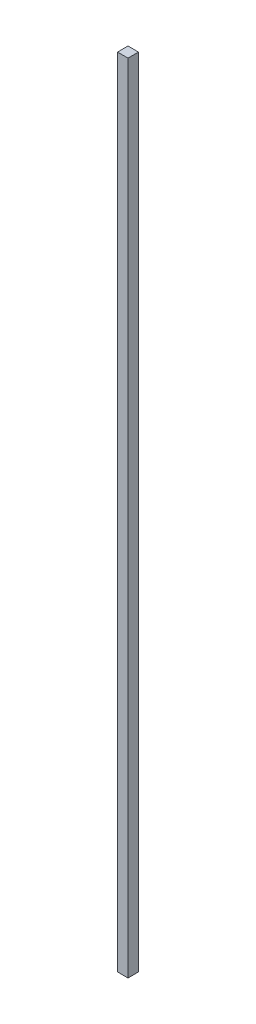
ISO-10303-21;
HEADER;
FILE_DESCRIPTION(('STEP AP214'),'2;1');
FILE_NAME('part.step','',(''),(''),'','','');
FILE_SCHEMA(('AUTOMOTIVE_DESIGN { 1 0 10303 214 1 1 1 1 }'));
ENDSEC;
DATA;
#1=APPLICATION_CONTEXT('core data for automotive mechanical design processes');
#2=APPLICATION_PROTOCOL_DEFINITION('international standard','automotive_design',2000,#1);
#3=PRODUCT_CONTEXT('',#1,'mechanical');
#4=PRODUCT('Part','Part','',(#3));
#5=PRODUCT_RELATED_PRODUCT_CATEGORY('part','',(#4));
#6=PRODUCT_DEFINITION_FORMATION('','',#4);
#7=PRODUCT_DEFINITION_CONTEXT('part definition',#1,'design');
#8=PRODUCT_DEFINITION('design','',#6,#7);
#9=PRODUCT_DEFINITION_SHAPE('','',#8);
#10=(LENGTH_UNIT() NAMED_UNIT(*) SI_UNIT(.MILLI.,.METRE.));
#11=(NAMED_UNIT(*) PLANE_ANGLE_UNIT() SI_UNIT($,.RADIAN.));
#12=(NAMED_UNIT(*) SI_UNIT($,.STERADIAN.) SOLID_ANGLE_UNIT());
#13=UNCERTAINTY_MEASURE_WITH_UNIT(LENGTH_MEASURE(1.E-05),#10,'distance_accuracy_value','');
#14=(GEOMETRIC_REPRESENTATION_CONTEXT(3) GLOBAL_UNCERTAINTY_ASSIGNED_CONTEXT((#13)) GLOBAL_UNIT_ASSIGNED_CONTEXT((#10,
#11,#12)) REPRESENTATION_CONTEXT('',''));
#15=CARTESIAN_POINT('',(0.,0.,0.));
#16=DIRECTION('',(0.,0.,1.));
#17=DIRECTION('',(1.,0.,0.));
#18=AXIS2_PLACEMENT_3D('',#15,#16,#17);
#19=CARTESIAN_POINT('',(3.175,241.3,0.));
#20=DIRECTION('',(0.,0.,-1.));
#21=DIRECTION('',(-1.,0.,0.));
#22=AXIS2_PLACEMENT_3D('',#19,#20,#21);
#23=PLANE('',#22);
#24=DIRECTION('',(1.,0.,0.));
#25=VECTOR('',#24,1.);
#26=CARTESIAN_POINT('',(3.175,0.,0.));
#27=LINE('',#26,#25);
#28=CARTESIAN_POINT('',(0.,0.,0.));
#29=VERTEX_POINT('',#28);
#30=CARTESIAN_POINT('',(3.175,0.,0.));
#31=VERTEX_POINT('',#30);
#32=EDGE_CURVE('E105',#29,#31,#27,.T.);
#33=ORIENTED_EDGE('',*,*,#32,.T.);
#34=DIRECTION('',(0.,-1.,0.));
#35=VECTOR('',#34,1.);
#36=CARTESIAN_POINT('',(3.175,241.3,0.));
#37=LINE('',#36,#35);
#38=CARTESIAN_POINT('',(3.175,241.3,0.));
#39=VERTEX_POINT('',#38);
#40=EDGE_CURVE('E11',#39,#31,#37,.T.);
#41=ORIENTED_EDGE('',*,*,#40,.F.);
#42=DIRECTION('',(1.,0.,0.));
#43=VECTOR('',#42,1.);
#44=CARTESIAN_POINT('',(3.175,241.3,0.));
#45=LINE('',#44,#43);
#46=CARTESIAN_POINT('',(0.,241.3,0.));
#47=VERTEX_POINT('',#46);
#48=EDGE_CURVE('E93',#47,#39,#45,.T.);
#49=ORIENTED_EDGE('',*,*,#48,.F.);
#50=DIRECTION('',(0.,-1.,0.));
#51=VECTOR('',#50,1.);
#52=CARTESIAN_POINT('',(0.,241.3,0.));
#53=LINE('',#52,#51);
#54=EDGE_CURVE('E101',#47,#29,#53,.T.);
#55=ORIENTED_EDGE('',*,*,#54,.T.);
#56=EDGE_LOOP('',(#33,#41,#49,#55));
#57=FACE_BOUND('',#56,.T.);
#58=ADVANCED_FACE('F42',(#57),#23,.F.);
#59=CARTESIAN_POINT('',(3.175,241.3,-3.175));
#60=DIRECTION('',(-1.,0.,0.));
#61=DIRECTION('',(0.,0.,1.));
#62=AXIS2_PLACEMENT_3D('',#59,#60,#61);
#63=PLANE('',#62);
#64=DIRECTION('',(0.,0.,-1.));
#65=VECTOR('',#64,1.);
#66=CARTESIAN_POINT('',(3.175,0.,-3.175));
#67=LINE('',#66,#65);
#68=CARTESIAN_POINT('',(3.175,0.,-3.175));
#69=VERTEX_POINT('',#68);
#70=EDGE_CURVE('E97',#31,#69,#67,.T.);
#71=ORIENTED_EDGE('',*,*,#70,.T.);
#72=DIRECTION('',(0.,-1.,0.));
#73=VECTOR('',#72,1.);
#74=CARTESIAN_POINT('',(3.175,241.3,-3.175));
#75=LINE('',#74,#73);
#76=CARTESIAN_POINT('',(3.175,241.3,-3.175));
#77=VERTEX_POINT('',#76);
#78=EDGE_CURVE('E50',#77,#69,#75,.T.);
#79=ORIENTED_EDGE('',*,*,#78,.F.);
#80=DIRECTION('',(0.,0.,-1.));
#81=VECTOR('',#80,1.);
#82=CARTESIAN_POINT('',(3.175,241.3,-3.175));
#83=LINE('',#82,#81);
#84=EDGE_CURVE('E88',#39,#77,#83,.T.);
#85=ORIENTED_EDGE('',*,*,#84,.F.);
#86=ORIENTED_EDGE('',*,*,#40,.T.);
#87=EDGE_LOOP('',(#71,#79,#85,#86));
#88=FACE_BOUND('',#87,.T.);
#89=ADVANCED_FACE('F96',(#88),#63,.F.);
#90=CARTESIAN_POINT('',(0.,241.3,-3.175));
#91=DIRECTION('',(0.,0.,1.));
#92=DIRECTION('',(1.,0.,0.));
#93=AXIS2_PLACEMENT_3D('',#90,#91,#92);
#94=PLANE('',#93);
#95=DIRECTION('',(-1.,0.,0.));
#96=VECTOR('',#95,1.);
#97=CARTESIAN_POINT('',(0.,0.,-3.175));
#98=LINE('',#97,#96);
#99=CARTESIAN_POINT('',(0.,0.,-3.175));
#100=VERTEX_POINT('',#99);
#101=EDGE_CURVE('E75',#69,#100,#98,.T.);
#102=ORIENTED_EDGE('',*,*,#101,.T.);
#103=DIRECTION('',(0.,-1.,0.));
#104=VECTOR('',#103,1.);
#105=CARTESIAN_POINT('',(0.,241.3,-3.175));
#106=LINE('',#105,#104);
#107=CARTESIAN_POINT('',(0.,241.3,-3.175));
#108=VERTEX_POINT('',#107);
#109=EDGE_CURVE('E98',#108,#100,#106,.T.);
#110=ORIENTED_EDGE('',*,*,#109,.F.);
#111=DIRECTION('',(-1.,0.,0.));
#112=VECTOR('',#111,1.);
#113=CARTESIAN_POINT('',(0.,241.3,-3.175));
#114=LINE('',#113,#112);
#115=EDGE_CURVE('E91',#77,#108,#114,.T.);
#116=ORIENTED_EDGE('',*,*,#115,.F.);
#117=ORIENTED_EDGE('',*,*,#78,.T.);
#118=EDGE_LOOP('',(#102,#110,#116,#117));
#119=FACE_BOUND('',#118,.T.);
#120=ADVANCED_FACE('F99',(#119),#94,.F.);
#121=CARTESIAN_POINT('',(0.,241.3,0.));
#122=DIRECTION('',(1.,0.,0.));
#123=DIRECTION('',(0.,0.,-1.));
#124=AXIS2_PLACEMENT_3D('',#121,#122,#123);
#125=PLANE('',#124);
#126=DIRECTION('',(0.,0.,1.));
#127=VECTOR('',#126,1.);
#128=CARTESIAN_POINT('',(0.,0.,0.));
#129=LINE('',#128,#127);
#130=EDGE_CURVE('E81',#100,#29,#129,.T.);
#131=ORIENTED_EDGE('',*,*,#130,.T.);
#132=ORIENTED_EDGE('',*,*,#54,.F.);
#133=DIRECTION('',(0.,0.,1.));
#134=VECTOR('',#133,1.);
#135=CARTESIAN_POINT('',(0.,241.3,0.));
#136=LINE('',#135,#134);
#137=EDGE_CURVE('E58',#108,#47,#136,.T.);
#138=ORIENTED_EDGE('',*,*,#137,.F.);
#139=ORIENTED_EDGE('',*,*,#109,.T.);
#140=EDGE_LOOP('',(#131,#132,#138,#139));
#141=FACE_BOUND('',#140,.T.);
#142=ADVANCED_FACE('F112',(#141),#125,.F.);
#143=CARTESIAN_POINT('',(0.,241.3,0.));
#144=DIRECTION('',(0.,-1.,0.));
#145=DIRECTION('',(0.,0.,-1.));
#146=AXIS2_PLACEMENT_3D('',#143,#144,#145);
#147=PLANE('',#146);
#148=ORIENTED_EDGE('',*,*,#48,.T.);
#149=ORIENTED_EDGE('',*,*,#84,.T.);
#150=ORIENTED_EDGE('',*,*,#115,.T.);
#151=ORIENTED_EDGE('',*,*,#137,.T.);
#152=EDGE_LOOP('',(#148,#149,#150,#151));
#153=FACE_BOUND('',#152,.T.);
#154=ADVANCED_FACE('F89',(#153),#147,.F.);
#155=CARTESIAN_POINT('',(0.,0.,0.));
#156=DIRECTION('',(0.,-1.,0.));
#157=DIRECTION('',(0.,0.,-1.));
#158=AXIS2_PLACEMENT_3D('',#155,#156,#157);
#159=PLANE('',#158);
#160=ORIENTED_EDGE('',*,*,#32,.F.);
#161=ORIENTED_EDGE('',*,*,#130,.F.);
#162=ORIENTED_EDGE('',*,*,#101,.F.);
#163=ORIENTED_EDGE('',*,*,#70,.F.);
#164=EDGE_LOOP('',(#160,#161,#162,#163));
#165=FACE_BOUND('',#164,.T.);
#166=ADVANCED_FACE('F115',(#165),#159,.T.);
#167=CLOSED_SHELL('',(#58,#89,#120,#142,#154,#166));
#168=MANIFOLD_SOLID_BREP('B2',#167);
#169=ADVANCED_BREP_SHAPE_REPRESENTATION('',(#18,#168),#14);
#170=SHAPE_DEFINITION_REPRESENTATION(#9,#169);
ENDSEC;
END-ISO-10303-21;
